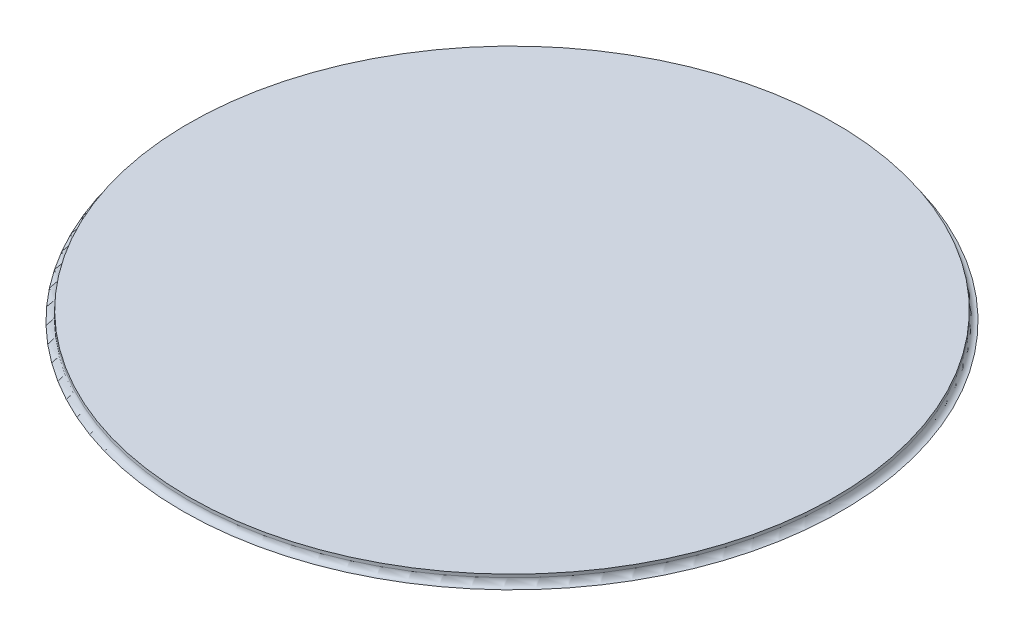
ISO-10303-21;
HEADER;
FILE_DESCRIPTION(('STEP AP214'),'2;1');
FILE_NAME('part.step','',(''),(''),'','','');
FILE_SCHEMA(('AUTOMOTIVE_DESIGN { 1 0 10303 214 1 1 1 1 }'));
ENDSEC;
DATA;
#1=APPLICATION_CONTEXT('core data for automotive mechanical design processes');
#2=APPLICATION_PROTOCOL_DEFINITION('international standard','automotive_design',2000,#1);
#3=PRODUCT_CONTEXT('',#1,'mechanical');
#4=PRODUCT('Part','Part','',(#3));
#5=PRODUCT_RELATED_PRODUCT_CATEGORY('part','',(#4));
#6=PRODUCT_DEFINITION_FORMATION('','',#4);
#7=PRODUCT_DEFINITION_CONTEXT('part definition',#1,'design');
#8=PRODUCT_DEFINITION('design','',#6,#7);
#9=PRODUCT_DEFINITION_SHAPE('','',#8);
#10=(LENGTH_UNIT() NAMED_UNIT(*) SI_UNIT(.MILLI.,.METRE.));
#11=(NAMED_UNIT(*) PLANE_ANGLE_UNIT() SI_UNIT($,.RADIAN.));
#12=(NAMED_UNIT(*) SI_UNIT($,.STERADIAN.) SOLID_ANGLE_UNIT());
#13=UNCERTAINTY_MEASURE_WITH_UNIT(LENGTH_MEASURE(1.E-05),#10,'distance_accuracy_value','');
#14=(GEOMETRIC_REPRESENTATION_CONTEXT(3) GLOBAL_UNCERTAINTY_ASSIGNED_CONTEXT((#13)) GLOBAL_UNIT_ASSIGNED_CONTEXT((#10,
#11,#12)) REPRESENTATION_CONTEXT('',''));
#15=CARTESIAN_POINT('',(0.,0.,0.));
#16=DIRECTION('',(0.,0.,1.));
#17=DIRECTION('',(1.,0.,0.));
#18=AXIS2_PLACEMENT_3D('',#15,#16,#17);
#19=CARTESIAN_POINT('',(0.,0.,65.));
#20=DIRECTION('',(0.,1.,0.));
#21=DIRECTION('',(0.,0.,1.));
#22=AXIS2_PLACEMENT_3D('',#19,#20,#21);
#23=PLANE('',#22);
#24=CARTESIAN_POINT('',(0.,0.,0.));
#25=DIRECTION('',(0.,1.,0.));
#26=DIRECTION('',(0.,0.,1.));
#27=AXIS2_PLACEMENT_3D('',#24,#25,#26);
#28=CIRCLE('',#27,53.5);
#29=CARTESIAN_POINT('',(0.,0.,53.5));
#30=VERTEX_POINT('',#29);
#31=EDGE_CURVE('E11',#30,#30,#28,.F.);
#32=ORIENTED_EDGE('',*,*,#31,.T.);
#33=EDGE_LOOP('',(#32));
#34=FACE_BOUND('',#33,.T.);
#35=ADVANCED_FACE('F38',(#34),#23,.F.);
#36=CARTESIAN_POINT('',(0.,1.5,0.));
#37=DIRECTION('',(0.,1.,0.));
#38=DIRECTION('',(0.,0.,1.));
#39=AXIS2_PLACEMENT_3D('',#36,#37,#38);
#40=PLANE('',#39);
#41=CARTESIAN_POINT('',(0.,1.5,0.));
#42=DIRECTION('',(0.,1.,0.));
#43=DIRECTION('',(0.,0.,1.));
#44=AXIS2_PLACEMENT_3D('',#41,#42,#43);
#45=CIRCLE('',#44,52.5);
#46=CARTESIAN_POINT('',(0.,1.5,52.5));
#47=VERTEX_POINT('',#46);
#48=EDGE_CURVE('E48',#47,#47,#45,.T.);
#49=ORIENTED_EDGE('',*,*,#48,.T.);
#50=EDGE_LOOP('',(#49));
#51=FACE_BOUND('',#50,.T.);
#52=ADVANCED_FACE('F55',(#51),#40,.T.);
#53=CARTESIAN_POINT('',(0.,1.5,0.));
#54=DIRECTION('',(0.,-1.,0.));
#55=DIRECTION('',(0.,0.,-1.));
#56=AXIS2_PLACEMENT_3D('',#53,#54,#55);
#57=CYLINDRICAL_SURFACE('',#56,52.5);
#58=CARTESIAN_POINT('',(0.,1.,0.));
#59=DIRECTION('',(0.,1.,0.));
#60=DIRECTION('',(0.,0.,1.));
#61=AXIS2_PLACEMENT_3D('',#58,#59,#60);
#62=CIRCLE('',#61,52.5);
#63=CARTESIAN_POINT('',(0.,1.,52.5));
#64=VERTEX_POINT('',#63);
#65=EDGE_CURVE('E44',#64,#64,#62,.T.);
#66=ORIENTED_EDGE('',*,*,#65,.T.);
#67=EDGE_LOOP('',(#66));
#68=FACE_BOUND('',#67,.T.);
#69=ORIENTED_EDGE('',*,*,#48,.F.);
#70=EDGE_LOOP('',(#69));
#71=FACE_BOUND('',#70,.T.);
#72=ADVANCED_FACE('F57',(#68,#71),#57,.T.);
#73=CARTESIAN_POINT('',(0.,1.,0.));
#74=DIRECTION('',(0.,1.,0.));
#75=DIRECTION('',(0.,0.,1.));
#76=AXIS2_PLACEMENT_3D('',#73,#74,#75);
#77=TOROIDAL_SURFACE('',#76,53.5,1.);
#78=ORIENTED_EDGE('',*,*,#31,.F.);
#79=EDGE_LOOP('',(#78));
#80=FACE_BOUND('',#79,.T.);
#81=ORIENTED_EDGE('',*,*,#65,.F.);
#82=EDGE_LOOP('',(#81));
#83=FACE_BOUND('',#82,.T.);
#84=ADVANCED_FACE('F59',(#80,#83),#77,.F.);
#85=CLOSED_SHELL('',(#35,#52,#72,#84));
#86=MANIFOLD_SOLID_BREP('B2',#85);
#87=ADVANCED_BREP_SHAPE_REPRESENTATION('',(#18,#86),#14);
#88=SHAPE_DEFINITION_REPRESENTATION(#9,#87);
ENDSEC;
END-ISO-10303-21;
